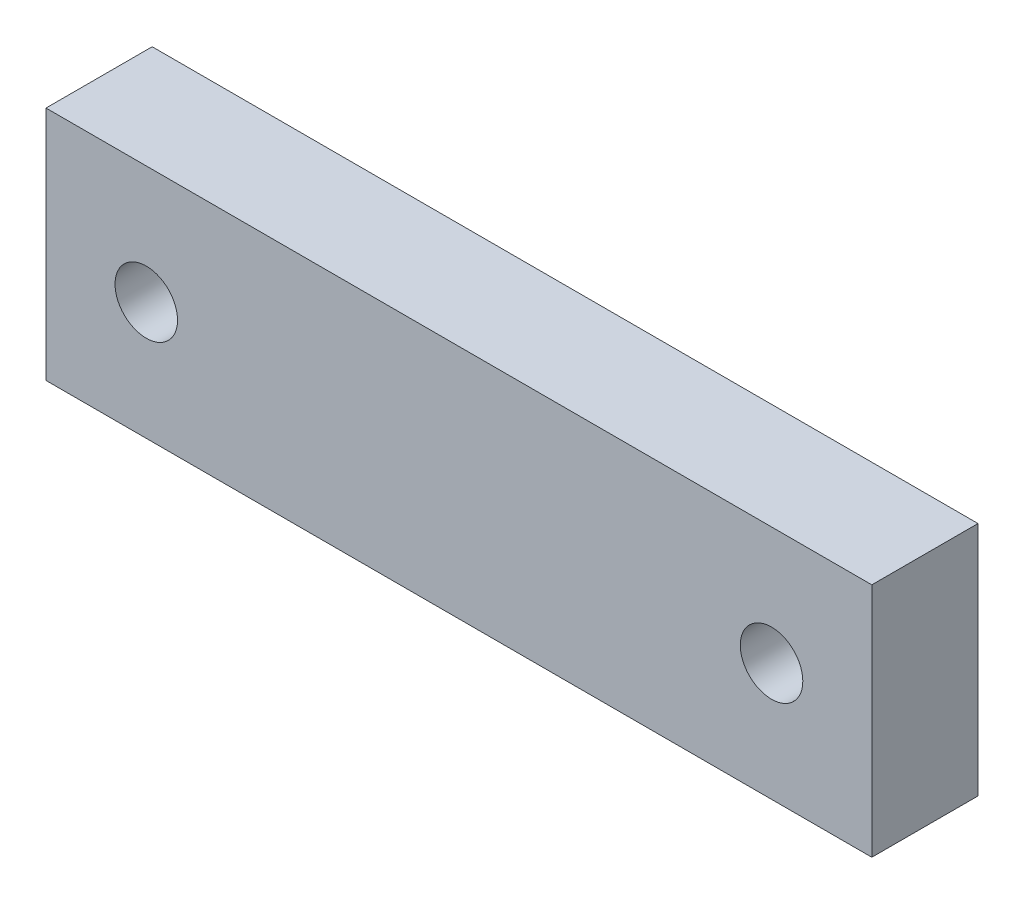
ISO-10303-21;
HEADER;
FILE_DESCRIPTION(('STEP AP214'),'2;1');
FILE_NAME('part.step','',(''),(''),'','','');
FILE_SCHEMA(('AUTOMOTIVE_DESIGN { 1 0 10303 214 1 1 1 1 }'));
ENDSEC;
DATA;
#1=APPLICATION_CONTEXT('core data for automotive mechanical design processes');
#2=APPLICATION_PROTOCOL_DEFINITION('international standard','automotive_design',2000,#1);
#3=PRODUCT_CONTEXT('',#1,'mechanical');
#4=PRODUCT('Part','Part','',(#3));
#5=PRODUCT_RELATED_PRODUCT_CATEGORY('part','',(#4));
#6=PRODUCT_DEFINITION_FORMATION('','',#4);
#7=PRODUCT_DEFINITION_CONTEXT('part definition',#1,'design');
#8=PRODUCT_DEFINITION('design','',#6,#7);
#9=PRODUCT_DEFINITION_SHAPE('','',#8);
#10=(LENGTH_UNIT() NAMED_UNIT(*) SI_UNIT(.MILLI.,.METRE.));
#11=(NAMED_UNIT(*) PLANE_ANGLE_UNIT() SI_UNIT($,.RADIAN.));
#12=(NAMED_UNIT(*) SI_UNIT($,.STERADIAN.) SOLID_ANGLE_UNIT());
#13=UNCERTAINTY_MEASURE_WITH_UNIT(LENGTH_MEASURE(1.E-05),#10,'distance_accuracy_value','');
#14=(GEOMETRIC_REPRESENTATION_CONTEXT(3) GLOBAL_UNCERTAINTY_ASSIGNED_CONTEXT((#13)) GLOBAL_UNIT_ASSIGNED_CONTEXT((#10,
#11,#12)) REPRESENTATION_CONTEXT('',''));
#15=CARTESIAN_POINT('',(0.,0.,0.));
#16=DIRECTION('',(0.,0.,1.));
#17=DIRECTION('',(1.,0.,0.));
#18=AXIS2_PLACEMENT_3D('',#15,#16,#17);
#19=CARTESIAN_POINT('',(0.,0.,9.));
#20=DIRECTION('',(0.,0.,1.));
#21=DIRECTION('',(1.,0.,0.));
#22=AXIS2_PLACEMENT_3D('',#19,#20,#21);
#23=PLANE('',#22);
#24=CARTESIAN_POINT('',(26.5000000000002,-52.5,9.));
#25=DIRECTION('',(0.,0.,1.));
#26=DIRECTION('',(1.,0.,0.));
#27=AXIS2_PLACEMENT_3D('',#24,#25,#26);
#28=CIRCLE('',#27,2.65);
#29=CARTESIAN_POINT('',(29.1500000000002,-52.5,9.));
#30=VERTEX_POINT('',#29);
#31=EDGE_CURVE('E100',#30,#30,#28,.T.);
#32=ORIENTED_EDGE('',*,*,#31,.F.);
#33=EDGE_LOOP('',(#32));
#34=FACE_BOUND('',#33,.T.);
#35=DIRECTION('',(0.,-1.,0.));
#36=VECTOR('',#35,1.);
#37=CARTESIAN_POINT('',(-35.,-42.5,9.));
#38=LINE('',#37,#36);
#39=CARTESIAN_POINT('',(-35.,-42.5,9.));
#40=VERTEX_POINT('',#39);
#41=CARTESIAN_POINT('',(-35.,-62.5,9.));
#42=VERTEX_POINT('',#41);
#43=EDGE_CURVE('E85',#40,#42,#38,.T.);
#44=ORIENTED_EDGE('',*,*,#43,.T.);
#45=DIRECTION('',(1.,0.,0.));
#46=VECTOR('',#45,1.);
#47=CARTESIAN_POINT('',(-35.,-62.5,9.));
#48=LINE('',#47,#46);
#49=CARTESIAN_POINT('',(35.,-62.5,9.));
#50=VERTEX_POINT('',#49);
#51=EDGE_CURVE('E80',#42,#50,#48,.T.);
#52=ORIENTED_EDGE('',*,*,#51,.T.);
#53=DIRECTION('',(0.,1.,0.));
#54=VECTOR('',#53,1.);
#55=CARTESIAN_POINT('',(35.,-42.5,9.));
#56=LINE('',#55,#54);
#57=CARTESIAN_POINT('',(35.,-42.5,9.));
#58=VERTEX_POINT('',#57);
#59=EDGE_CURVE('E83',#50,#58,#56,.T.);
#60=ORIENTED_EDGE('',*,*,#59,.T.);
#61=DIRECTION('',(-1.,0.,0.));
#62=VECTOR('',#61,1.);
#63=CARTESIAN_POINT('',(-35.,-42.5,9.));
#64=LINE('',#63,#62);
#65=EDGE_CURVE('E50',#58,#40,#64,.T.);
#66=ORIENTED_EDGE('',*,*,#65,.T.);
#67=EDGE_LOOP('',(#44,#52,#60,#66));
#68=FACE_BOUND('',#67,.T.);
#69=CARTESIAN_POINT('',(-26.4999999999998,-52.5,9.));
#70=DIRECTION('',(0.,0.,1.));
#71=DIRECTION('',(1.,0.,0.));
#72=AXIS2_PLACEMENT_3D('',#69,#70,#71);
#73=CIRCLE('',#72,2.65);
#74=CARTESIAN_POINT('',(-23.8499999999998,-52.5,9.));
#75=VERTEX_POINT('',#74);
#76=EDGE_CURVE('E115',#75,#75,#73,.T.);
#77=ORIENTED_EDGE('',*,*,#76,.F.);
#78=EDGE_LOOP('',(#77));
#79=FACE_BOUND('',#78,.T.);
#80=ADVANCED_FACE('F33',(#34,#68,#79),#23,.T.);
#81=CARTESIAN_POINT('',(0.,0.,0.));
#82=DIRECTION('',(0.,0.,1.));
#83=DIRECTION('',(1.,0.,0.));
#84=AXIS2_PLACEMENT_3D('',#81,#82,#83);
#85=PLANE('',#84);
#86=DIRECTION('',(0.,-1.,0.));
#87=VECTOR('',#86,1.);
#88=CARTESIAN_POINT('',(-35.,-42.5,0.));
#89=LINE('',#88,#87);
#90=CARTESIAN_POINT('',(-35.,-42.5,0.));
#91=VERTEX_POINT('',#90);
#92=CARTESIAN_POINT('',(-35.,-62.5,0.));
#93=VERTEX_POINT('',#92);
#94=EDGE_CURVE('E97',#91,#93,#89,.T.);
#95=ORIENTED_EDGE('',*,*,#94,.F.);
#96=DIRECTION('',(-1.,0.,0.));
#97=VECTOR('',#96,1.);
#98=CARTESIAN_POINT('',(-35.,-42.5,0.));
#99=LINE('',#98,#97);
#100=CARTESIAN_POINT('',(35.,-42.5,0.));
#101=VERTEX_POINT('',#100);
#102=EDGE_CURVE('E73',#101,#91,#99,.T.);
#103=ORIENTED_EDGE('',*,*,#102,.F.);
#104=DIRECTION('',(0.,1.,0.));
#105=VECTOR('',#104,1.);
#106=CARTESIAN_POINT('',(35.,-42.5,0.));
#107=LINE('',#106,#105);
#108=CARTESIAN_POINT('',(35.,-62.5,0.));
#109=VERTEX_POINT('',#108);
#110=EDGE_CURVE('E67',#109,#101,#107,.T.);
#111=ORIENTED_EDGE('',*,*,#110,.F.);
#112=DIRECTION('',(1.,0.,0.));
#113=VECTOR('',#112,1.);
#114=CARTESIAN_POINT('',(-35.,-62.5,0.));
#115=LINE('',#114,#113);
#116=EDGE_CURVE('E89',#93,#109,#115,.T.);
#117=ORIENTED_EDGE('',*,*,#116,.F.);
#118=EDGE_LOOP('',(#95,#103,#111,#117));
#119=FACE_BOUND('',#118,.T.);
#120=CARTESIAN_POINT('',(26.5000000000002,-52.5,0.));
#121=DIRECTION('',(0.,0.,1.));
#122=DIRECTION('',(1.,0.,0.));
#123=AXIS2_PLACEMENT_3D('',#120,#121,#122);
#124=CIRCLE('',#123,2.65);
#125=CARTESIAN_POINT('',(29.1500000000002,-52.5,0.));
#126=VERTEX_POINT('',#125);
#127=EDGE_CURVE('E112',#126,#126,#124,.T.);
#128=ORIENTED_EDGE('',*,*,#127,.T.);
#129=EDGE_LOOP('',(#128));
#130=FACE_BOUND('',#129,.T.);
#131=CARTESIAN_POINT('',(-26.4999999999998,-52.5,0.));
#132=DIRECTION('',(0.,0.,1.));
#133=DIRECTION('',(1.,0.,0.));
#134=AXIS2_PLACEMENT_3D('',#131,#132,#133);
#135=CIRCLE('',#134,2.65);
#136=CARTESIAN_POINT('',(-23.8499999999998,-52.5,0.));
#137=VERTEX_POINT('',#136);
#138=EDGE_CURVE('E118',#137,#137,#135,.T.);
#139=ORIENTED_EDGE('',*,*,#138,.T.);
#140=EDGE_LOOP('',(#139));
#141=FACE_BOUND('',#140,.T.);
#142=ADVANCED_FACE('F108',(#119,#130,#141),#85,.F.);
#143=CARTESIAN_POINT('',(-35.,-42.5,9.));
#144=DIRECTION('',(1.,0.,0.));
#145=DIRECTION('',(0.,1.,0.));
#146=AXIS2_PLACEMENT_3D('',#143,#144,#145);
#147=PLANE('',#146);
#148=ORIENTED_EDGE('',*,*,#94,.T.);
#149=DIRECTION('',(0.,0.,-1.));
#150=VECTOR('',#149,1.);
#151=CARTESIAN_POINT('',(-35.,-62.5,9.));
#152=LINE('',#151,#150);
#153=EDGE_CURVE('E11',#42,#93,#152,.T.);
#154=ORIENTED_EDGE('',*,*,#153,.F.);
#155=ORIENTED_EDGE('',*,*,#43,.F.);
#156=DIRECTION('',(0.,0.,-1.));
#157=VECTOR('',#156,1.);
#158=CARTESIAN_POINT('',(-35.,-42.5,9.));
#159=LINE('',#158,#157);
#160=EDGE_CURVE('E93',#40,#91,#159,.T.);
#161=ORIENTED_EDGE('',*,*,#160,.T.);
#162=EDGE_LOOP('',(#148,#154,#155,#161));
#163=FACE_BOUND('',#162,.T.);
#164=ADVANCED_FACE('F35',(#163),#147,.F.);
#165=CARTESIAN_POINT('',(-35.,-62.5,9.));
#166=DIRECTION('',(0.,1.,0.));
#167=DIRECTION('',(0.,0.,1.));
#168=AXIS2_PLACEMENT_3D('',#165,#166,#167);
#169=PLANE('',#168);
#170=ORIENTED_EDGE('',*,*,#116,.T.);
#171=DIRECTION('',(0.,0.,-1.));
#172=VECTOR('',#171,1.);
#173=CARTESIAN_POINT('',(35.,-62.5,9.));
#174=LINE('',#173,#172);
#175=EDGE_CURVE('E42',#50,#109,#174,.T.);
#176=ORIENTED_EDGE('',*,*,#175,.F.);
#177=ORIENTED_EDGE('',*,*,#51,.F.);
#178=ORIENTED_EDGE('',*,*,#153,.T.);
#179=EDGE_LOOP('',(#170,#176,#177,#178));
#180=FACE_BOUND('',#179,.T.);
#181=ADVANCED_FACE('F88',(#180),#169,.F.);
#182=CARTESIAN_POINT('',(35.,-42.5,9.));
#183=DIRECTION('',(-1.,0.,0.));
#184=DIRECTION('',(0.,0.,1.));
#185=AXIS2_PLACEMENT_3D('',#182,#183,#184);
#186=PLANE('',#185);
#187=ORIENTED_EDGE('',*,*,#110,.T.);
#188=DIRECTION('',(0.,0.,-1.));
#189=VECTOR('',#188,1.);
#190=CARTESIAN_POINT('',(35.,-42.5,9.));
#191=LINE('',#190,#189);
#192=EDGE_CURVE('E90',#58,#101,#191,.T.);
#193=ORIENTED_EDGE('',*,*,#192,.F.);
#194=ORIENTED_EDGE('',*,*,#59,.F.);
#195=ORIENTED_EDGE('',*,*,#175,.T.);
#196=EDGE_LOOP('',(#187,#193,#194,#195));
#197=FACE_BOUND('',#196,.T.);
#198=ADVANCED_FACE('F91',(#197),#186,.F.);
#199=CARTESIAN_POINT('',(-35.,-42.5,9.));
#200=DIRECTION('',(0.,-1.,0.));
#201=DIRECTION('',(0.,0.,-1.));
#202=AXIS2_PLACEMENT_3D('',#199,#200,#201);
#203=PLANE('',#202);
#204=ORIENTED_EDGE('',*,*,#102,.T.);
#205=ORIENTED_EDGE('',*,*,#160,.F.);
#206=ORIENTED_EDGE('',*,*,#65,.F.);
#207=ORIENTED_EDGE('',*,*,#192,.T.);
#208=EDGE_LOOP('',(#204,#205,#206,#207));
#209=FACE_BOUND('',#208,.T.);
#210=ADVANCED_FACE('F105',(#209),#203,.F.);
#211=CARTESIAN_POINT('',(26.5000000000002,-52.5,9.));
#212=DIRECTION('',(0.,0.,-1.));
#213=DIRECTION('',(-1.,0.,0.));
#214=AXIS2_PLACEMENT_3D('',#211,#212,#213);
#215=CYLINDRICAL_SURFACE('',#214,2.65);
#216=ORIENTED_EDGE('',*,*,#31,.T.);
#217=EDGE_LOOP('',(#216));
#218=FACE_BOUND('',#217,.T.);
#219=ORIENTED_EDGE('',*,*,#127,.F.);
#220=EDGE_LOOP('',(#219));
#221=FACE_BOUND('',#220,.T.);
#222=ADVANCED_FACE('F135',(#218,#221),#215,.F.);
#223=CARTESIAN_POINT('',(-26.4999999999998,-52.5,9.));
#224=DIRECTION('',(0.,0.,-1.));
#225=DIRECTION('',(-1.,0.,0.));
#226=AXIS2_PLACEMENT_3D('',#223,#224,#225);
#227=CYLINDRICAL_SURFACE('',#226,2.65);
#228=ORIENTED_EDGE('',*,*,#76,.T.);
#229=EDGE_LOOP('',(#228));
#230=FACE_BOUND('',#229,.T.);
#231=ORIENTED_EDGE('',*,*,#138,.F.);
#232=EDGE_LOOP('',(#231));
#233=FACE_BOUND('',#232,.T.);
#234=ADVANCED_FACE('F124',(#230,#233),#227,.F.);
#235=CLOSED_SHELL('',(#80,#142,#164,#181,#198,#210,#222,#234));
#236=MANIFOLD_SOLID_BREP('B2',#235);
#237=ADVANCED_BREP_SHAPE_REPRESENTATION('',(#18,#236),#14);
#238=SHAPE_DEFINITION_REPRESENTATION(#9,#237);
ENDSEC;
END-ISO-10303-21;
